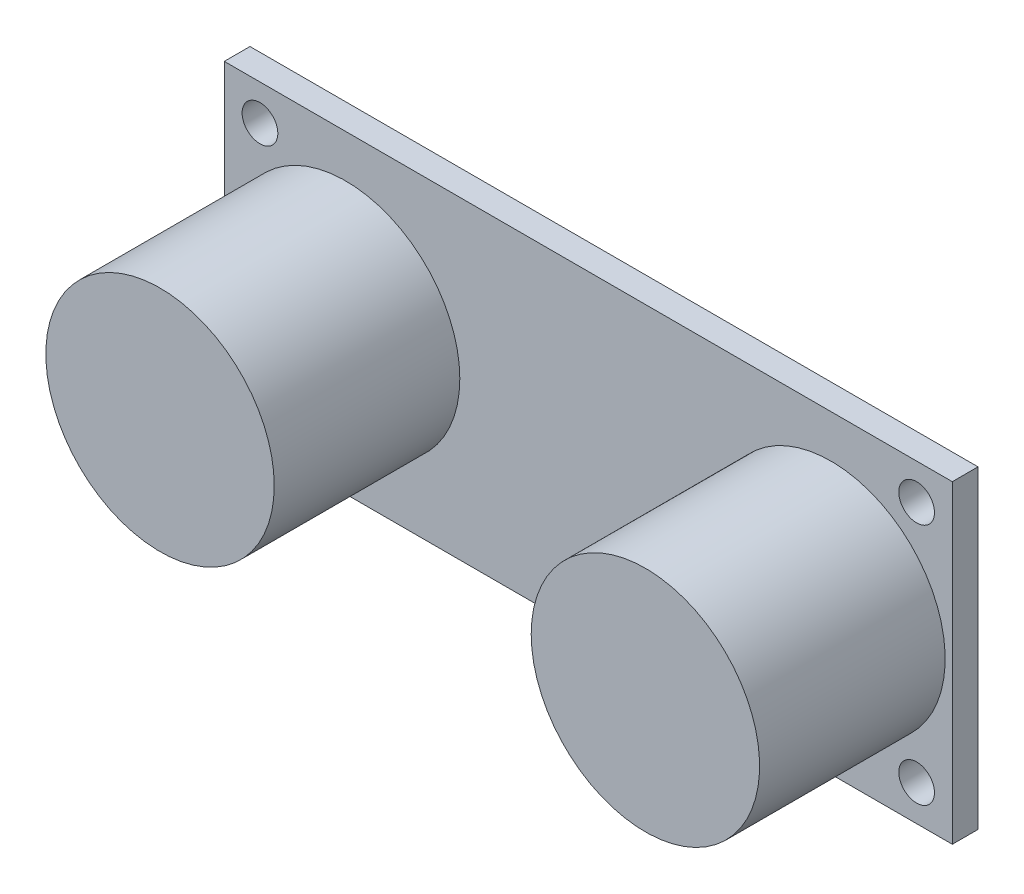
ISO-10303-21;
HEADER;
FILE_DESCRIPTION(('STEP AP214'),'2;1');
FILE_NAME('part.step','',(''),(''),'','','');
FILE_SCHEMA(('AUTOMOTIVE_DESIGN { 1 0 10303 214 1 1 1 1 }'));
ENDSEC;
DATA;
#1=APPLICATION_CONTEXT('core data for automotive mechanical design processes');
#2=APPLICATION_PROTOCOL_DEFINITION('international standard','automotive_design',2000,#1);
#3=PRODUCT_CONTEXT('',#1,'mechanical');
#4=PRODUCT('Part','Part','',(#3));
#5=PRODUCT_RELATED_PRODUCT_CATEGORY('part','',(#4));
#6=PRODUCT_DEFINITION_FORMATION('','',#4);
#7=PRODUCT_DEFINITION_CONTEXT('part definition',#1,'design');
#8=PRODUCT_DEFINITION('design','',#6,#7);
#9=PRODUCT_DEFINITION_SHAPE('','',#8);
#10=(LENGTH_UNIT() NAMED_UNIT(*) SI_UNIT(.MILLI.,.METRE.));
#11=(NAMED_UNIT(*) PLANE_ANGLE_UNIT() SI_UNIT($,.RADIAN.));
#12=(NAMED_UNIT(*) SI_UNIT($,.STERADIAN.) SOLID_ANGLE_UNIT());
#13=UNCERTAINTY_MEASURE_WITH_UNIT(LENGTH_MEASURE(1.E-05),#10,'distance_accuracy_value','');
#14=(GEOMETRIC_REPRESENTATION_CONTEXT(3) GLOBAL_UNCERTAINTY_ASSIGNED_CONTEXT((#13)) GLOBAL_UNIT_ASSIGNED_CONTEXT((#10,
#11,#12)) REPRESENTATION_CONTEXT('',''));
#15=CARTESIAN_POINT('',(0.,0.,0.));
#16=DIRECTION('',(0.,0.,1.));
#17=DIRECTION('',(1.,0.,0.));
#18=AXIS2_PLACEMENT_3D('',#15,#16,#17);
#19=CARTESIAN_POINT('',(0.,0.,1.8));
#20=DIRECTION('',(0.,0.,1.));
#21=DIRECTION('',(1.,0.,0.));
#22=AXIS2_PLACEMENT_3D('',#19,#20,#21);
#23=PLANE('',#22);
#24=CARTESIAN_POINT('',(17.,0.,1.8));
#25=DIRECTION('',(0.,0.,1.));
#26=DIRECTION('',(-1.,0.,0.));
#27=AXIS2_PLACEMENT_3D('',#24,#25,#26);
#28=CIRCLE('',#27,8.);
#29=CARTESIAN_POINT('',(9.,0.,1.8));
#30=VERTEX_POINT('',#29);
#31=EDGE_CURVE('E170',#30,#30,#28,.T.);
#32=ORIENTED_EDGE('',*,*,#31,.F.);
#33=EDGE_LOOP('',(#32));
#34=FACE_BOUND('',#33,.T.);
#35=CARTESIAN_POINT('',(-17.,0.,1.8));
#36=DIRECTION('',(0.,0.,1.));
#37=DIRECTION('',(1.,0.,0.));
#38=AXIS2_PLACEMENT_3D('',#35,#36,#37);
#39=CIRCLE('',#38,8.);
#40=CARTESIAN_POINT('',(-9.,0.,1.8));
#41=VERTEX_POINT('',#40);
#42=EDGE_CURVE('E162',#41,#41,#39,.T.);
#43=ORIENTED_EDGE('',*,*,#42,.F.);
#44=EDGE_LOOP('',(#43));
#45=FACE_BOUND('',#44,.T.);
#46=CARTESIAN_POINT('',(23.,8.49999999999999,1.8));
#47=DIRECTION('',(0.,0.,1.));
#48=DIRECTION('',(1.,0.,0.));
#49=AXIS2_PLACEMENT_3D('',#46,#47,#48);
#50=CIRCLE('',#49,1.25);
#51=CARTESIAN_POINT('',(24.25,8.49999999999999,1.8));
#52=VERTEX_POINT('',#51);
#53=EDGE_CURVE('E142',#52,#52,#50,.T.);
#54=ORIENTED_EDGE('',*,*,#53,.F.);
#55=EDGE_LOOP('',(#54));
#56=FACE_BOUND('',#55,.T.);
#57=CARTESIAN_POINT('',(-23.,-8.5,1.8));
#58=DIRECTION('',(0.,0.,1.));
#59=DIRECTION('',(1.,0.,0.));
#60=AXIS2_PLACEMENT_3D('',#57,#58,#59);
#61=CIRCLE('',#60,1.25);
#62=CARTESIAN_POINT('',(-21.75,-8.5,1.8));
#63=VERTEX_POINT('',#62);
#64=EDGE_CURVE('E112',#63,#63,#61,.T.);
#65=ORIENTED_EDGE('',*,*,#64,.F.);
#66=EDGE_LOOP('',(#65));
#67=FACE_BOUND('',#66,.T.);
#68=DIRECTION('',(0.,1.,0.));
#69=VECTOR('',#68,1.);
#70=CARTESIAN_POINT('',(25.5,11.,1.8));
#71=LINE('',#70,#69);
#72=CARTESIAN_POINT('',(25.5,-11.,1.8));
#73=VERTEX_POINT('',#72);
#74=CARTESIAN_POINT('',(25.5,11.,1.8));
#75=VERTEX_POINT('',#74);
#76=EDGE_CURVE('E92',#73,#75,#71,.T.);
#77=ORIENTED_EDGE('',*,*,#76,.T.);
#78=DIRECTION('',(-1.,0.,0.));
#79=VECTOR('',#78,1.);
#80=CARTESIAN_POINT('',(-25.5,11.,1.8));
#81=LINE('',#80,#79);
#82=CARTESIAN_POINT('',(-25.5,11.,1.8));
#83=VERTEX_POINT('',#82);
#84=EDGE_CURVE('E87',#75,#83,#81,.T.);
#85=ORIENTED_EDGE('',*,*,#84,.T.);
#86=DIRECTION('',(0.,-1.,0.));
#87=VECTOR('',#86,1.);
#88=CARTESIAN_POINT('',(-25.5,11.,1.8));
#89=LINE('',#88,#87);
#90=CARTESIAN_POINT('',(-25.5,-11.,1.8));
#91=VERTEX_POINT('',#90);
#92=EDGE_CURVE('E90',#83,#91,#89,.T.);
#93=ORIENTED_EDGE('',*,*,#92,.T.);
#94=DIRECTION('',(1.,0.,0.));
#95=VECTOR('',#94,1.);
#96=CARTESIAN_POINT('',(-25.5,-11.,1.8));
#97=LINE('',#96,#95);
#98=EDGE_CURVE('E57',#91,#73,#97,.T.);
#99=ORIENTED_EDGE('',*,*,#98,.T.);
#100=EDGE_LOOP('',(#77,#85,#93,#99));
#101=FACE_BOUND('',#100,.T.);
#102=CARTESIAN_POINT('',(-23.,8.5,1.8));
#103=DIRECTION('',(0.,0.,1.));
#104=DIRECTION('',(-1.,0.,0.));
#105=AXIS2_PLACEMENT_3D('',#102,#103,#104);
#106=CIRCLE('',#105,1.25);
#107=CARTESIAN_POINT('',(-24.25,8.5,1.8));
#108=VERTEX_POINT('',#107);
#109=EDGE_CURVE('E134',#108,#108,#106,.T.);
#110=ORIENTED_EDGE('',*,*,#109,.F.);
#111=EDGE_LOOP('',(#110));
#112=FACE_BOUND('',#111,.T.);
#113=CARTESIAN_POINT('',(23.,-8.49999999999999,1.8));
#114=DIRECTION('',(0.,0.,1.));
#115=DIRECTION('',(-1.,0.,0.));
#116=AXIS2_PLACEMENT_3D('',#113,#114,#115);
#117=CIRCLE('',#116,1.25);
#118=CARTESIAN_POINT('',(21.75,-8.49999999999999,1.8));
#119=VERTEX_POINT('',#118);
#120=EDGE_CURVE('E150',#119,#119,#117,.T.);
#121=ORIENTED_EDGE('',*,*,#120,.F.);
#122=EDGE_LOOP('',(#121));
#123=FACE_BOUND('',#122,.T.);
#124=ADVANCED_FACE('F39',(#34,#45,#56,#67,#101,#112,#123),#23,.T.);
#125=CARTESIAN_POINT('',(0.,0.,0.));
#126=DIRECTION('',(0.,0.,1.));
#127=DIRECTION('',(1.,0.,0.));
#128=AXIS2_PLACEMENT_3D('',#125,#126,#127);
#129=PLANE('',#128);
#130=DIRECTION('',(0.,1.,0.));
#131=VECTOR('',#130,1.);
#132=CARTESIAN_POINT('',(25.5,11.,0.));
#133=LINE('',#132,#131);
#134=CARTESIAN_POINT('',(25.5,-11.,0.));
#135=VERTEX_POINT('',#134);
#136=CARTESIAN_POINT('',(25.5,11.,0.));
#137=VERTEX_POINT('',#136);
#138=EDGE_CURVE('E108',#135,#137,#133,.T.);
#139=ORIENTED_EDGE('',*,*,#138,.F.);
#140=DIRECTION('',(1.,0.,0.));
#141=VECTOR('',#140,1.);
#142=CARTESIAN_POINT('',(-25.5,-11.,0.));
#143=LINE('',#142,#141);
#144=CARTESIAN_POINT('',(-25.5,-11.,0.));
#145=VERTEX_POINT('',#144);
#146=EDGE_CURVE('E80',#145,#135,#143,.T.);
#147=ORIENTED_EDGE('',*,*,#146,.F.);
#148=DIRECTION('',(0.,-1.,0.));
#149=VECTOR('',#148,1.);
#150=CARTESIAN_POINT('',(-25.5,11.,0.));
#151=LINE('',#150,#149);
#152=CARTESIAN_POINT('',(-25.5,11.,0.));
#153=VERTEX_POINT('',#152);
#154=EDGE_CURVE('E74',#153,#145,#151,.T.);
#155=ORIENTED_EDGE('',*,*,#154,.F.);
#156=DIRECTION('',(-1.,0.,0.));
#157=VECTOR('',#156,1.);
#158=CARTESIAN_POINT('',(-25.5,11.,0.));
#159=LINE('',#158,#157);
#160=EDGE_CURVE('E97',#137,#153,#159,.T.);
#161=ORIENTED_EDGE('',*,*,#160,.F.);
#162=EDGE_LOOP('',(#139,#147,#155,#161));
#163=FACE_BOUND('',#162,.T.);
#164=CARTESIAN_POINT('',(-23.,-8.5,0.));
#165=DIRECTION('',(0.,0.,1.));
#166=DIRECTION('',(1.,0.,0.));
#167=AXIS2_PLACEMENT_3D('',#164,#165,#166);
#168=CIRCLE('',#167,1.25);
#169=CARTESIAN_POINT('',(-21.75,-8.5,0.));
#170=VERTEX_POINT('',#169);
#171=EDGE_CURVE('E130',#170,#170,#168,.T.);
#172=ORIENTED_EDGE('',*,*,#171,.T.);
#173=EDGE_LOOP('',(#172));
#174=FACE_BOUND('',#173,.T.);
#175=CARTESIAN_POINT('',(-23.,8.5,0.));
#176=DIRECTION('',(0.,0.,1.));
#177=DIRECTION('',(-1.,0.,0.));
#178=AXIS2_PLACEMENT_3D('',#175,#176,#177);
#179=CIRCLE('',#178,1.25);
#180=CARTESIAN_POINT('',(-24.25,8.5,0.));
#181=VERTEX_POINT('',#180);
#182=EDGE_CURVE('E138',#181,#181,#179,.T.);
#183=ORIENTED_EDGE('',*,*,#182,.T.);
#184=EDGE_LOOP('',(#183));
#185=FACE_BOUND('',#184,.T.);
#186=CARTESIAN_POINT('',(23.,8.49999999999999,0.));
#187=DIRECTION('',(0.,0.,1.));
#188=DIRECTION('',(1.,0.,0.));
#189=AXIS2_PLACEMENT_3D('',#186,#187,#188);
#190=CIRCLE('',#189,1.25);
#191=CARTESIAN_POINT('',(24.25,8.49999999999999,0.));
#192=VERTEX_POINT('',#191);
#193=EDGE_CURVE('E146',#192,#192,#190,.T.);
#194=ORIENTED_EDGE('',*,*,#193,.T.);
#195=EDGE_LOOP('',(#194));
#196=FACE_BOUND('',#195,.T.);
#197=CARTESIAN_POINT('',(23.,-8.49999999999999,0.));
#198=DIRECTION('',(0.,0.,1.));
#199=DIRECTION('',(-1.,0.,0.));
#200=AXIS2_PLACEMENT_3D('',#197,#198,#199);
#201=CIRCLE('',#200,1.25);
#202=CARTESIAN_POINT('',(21.75,-8.49999999999999,0.));
#203=VERTEX_POINT('',#202);
#204=EDGE_CURVE('E154',#203,#203,#201,.T.);
#205=ORIENTED_EDGE('',*,*,#204,.T.);
#206=EDGE_LOOP('',(#205));
#207=FACE_BOUND('',#206,.T.);
#208=ADVANCED_FACE('F125',(#163,#174,#185,#196,#207),#129,.F.);
#209=CARTESIAN_POINT('',(25.5,11.,1.8));
#210=DIRECTION('',(-1.,0.,0.));
#211=DIRECTION('',(0.,0.,1.));
#212=AXIS2_PLACEMENT_3D('',#209,#210,#211);
#213=PLANE('',#212);
#214=ORIENTED_EDGE('',*,*,#138,.T.);
#215=DIRECTION('',(0.,0.,-1.));
#216=VECTOR('',#215,1.);
#217=CARTESIAN_POINT('',(25.5,11.,1.8));
#218=LINE('',#217,#216);
#219=EDGE_CURVE('E11',#75,#137,#218,.T.);
#220=ORIENTED_EDGE('',*,*,#219,.F.);
#221=ORIENTED_EDGE('',*,*,#76,.F.);
#222=DIRECTION('',(0.,0.,-1.));
#223=VECTOR('',#222,1.);
#224=CARTESIAN_POINT('',(25.5,-11.,1.8));
#225=LINE('',#224,#223);
#226=EDGE_CURVE('E104',#73,#135,#225,.T.);
#227=ORIENTED_EDGE('',*,*,#226,.T.);
#228=EDGE_LOOP('',(#214,#220,#221,#227));
#229=FACE_BOUND('',#228,.T.);
#230=ADVANCED_FACE('F41',(#229),#213,.F.);
#231=CARTESIAN_POINT('',(-25.5,11.,1.8));
#232=DIRECTION('',(0.,-1.,0.));
#233=DIRECTION('',(0.,0.,-1.));
#234=AXIS2_PLACEMENT_3D('',#231,#232,#233);
#235=PLANE('',#234);
#236=ORIENTED_EDGE('',*,*,#160,.T.);
#237=DIRECTION('',(0.,0.,-1.));
#238=VECTOR('',#237,1.);
#239=CARTESIAN_POINT('',(-25.5,11.,1.8));
#240=LINE('',#239,#238);
#241=EDGE_CURVE('E49',#83,#153,#240,.T.);
#242=ORIENTED_EDGE('',*,*,#241,.F.);
#243=ORIENTED_EDGE('',*,*,#84,.F.);
#244=ORIENTED_EDGE('',*,*,#219,.T.);
#245=EDGE_LOOP('',(#236,#242,#243,#244));
#246=FACE_BOUND('',#245,.T.);
#247=ADVANCED_FACE('F96',(#246),#235,.F.);
#248=CARTESIAN_POINT('',(-25.5,11.,1.8));
#249=DIRECTION('',(1.,0.,0.));
#250=DIRECTION('',(0.,1.,0.));
#251=AXIS2_PLACEMENT_3D('',#248,#249,#250);
#252=PLANE('',#251);
#253=ORIENTED_EDGE('',*,*,#154,.T.);
#254=DIRECTION('',(0.,0.,-1.));
#255=VECTOR('',#254,1.);
#256=CARTESIAN_POINT('',(-25.5,-11.,1.8));
#257=LINE('',#256,#255);
#258=EDGE_CURVE('E99',#91,#145,#257,.T.);
#259=ORIENTED_EDGE('',*,*,#258,.F.);
#260=ORIENTED_EDGE('',*,*,#92,.F.);
#261=ORIENTED_EDGE('',*,*,#241,.T.);
#262=EDGE_LOOP('',(#253,#259,#260,#261));
#263=FACE_BOUND('',#262,.T.);
#264=ADVANCED_FACE('F100',(#263),#252,.F.);
#265=CARTESIAN_POINT('',(-25.5,-11.,1.8));
#266=DIRECTION('',(0.,1.,0.));
#267=DIRECTION('',(0.,0.,1.));
#268=AXIS2_PLACEMENT_3D('',#265,#266,#267);
#269=PLANE('',#268);
#270=ORIENTED_EDGE('',*,*,#146,.T.);
#271=ORIENTED_EDGE('',*,*,#226,.F.);
#272=ORIENTED_EDGE('',*,*,#98,.F.);
#273=ORIENTED_EDGE('',*,*,#258,.T.);
#274=EDGE_LOOP('',(#270,#271,#272,#273));
#275=FACE_BOUND('',#274,.T.);
#276=ADVANCED_FACE('F122',(#275),#269,.F.);
#277=CARTESIAN_POINT('',(-23.,-8.5,1.8));
#278=DIRECTION('',(0.,0.,-1.));
#279=DIRECTION('',(-1.,0.,0.));
#280=AXIS2_PLACEMENT_3D('',#277,#278,#279);
#281=CYLINDRICAL_SURFACE('',#280,1.25);
#282=ORIENTED_EDGE('',*,*,#64,.T.);
#283=EDGE_LOOP('',(#282));
#284=FACE_BOUND('',#283,.T.);
#285=ORIENTED_EDGE('',*,*,#171,.F.);
#286=EDGE_LOOP('',(#285));
#287=FACE_BOUND('',#286,.T.);
#288=ADVANCED_FACE('F196',(#284,#287),#281,.F.);
#289=CARTESIAN_POINT('',(-23.,8.5,1.8));
#290=DIRECTION('',(0.,0.,-1.));
#291=DIRECTION('',(-1.,0.,0.));
#292=AXIS2_PLACEMENT_3D('',#289,#290,#291);
#293=CYLINDRICAL_SURFACE('',#292,1.25);
#294=ORIENTED_EDGE('',*,*,#109,.T.);
#295=EDGE_LOOP('',(#294));
#296=FACE_BOUND('',#295,.T.);
#297=ORIENTED_EDGE('',*,*,#182,.F.);
#298=EDGE_LOOP('',(#297));
#299=FACE_BOUND('',#298,.T.);
#300=ADVANCED_FACE('F199',(#296,#299),#293,.F.);
#301=CARTESIAN_POINT('',(23.,8.49999999999999,1.8));
#302=DIRECTION('',(0.,0.,-1.));
#303=DIRECTION('',(-1.,0.,0.));
#304=AXIS2_PLACEMENT_3D('',#301,#302,#303);
#305=CYLINDRICAL_SURFACE('',#304,1.25);
#306=ORIENTED_EDGE('',*,*,#53,.T.);
#307=EDGE_LOOP('',(#306));
#308=FACE_BOUND('',#307,.T.);
#309=ORIENTED_EDGE('',*,*,#193,.F.);
#310=EDGE_LOOP('',(#309));
#311=FACE_BOUND('',#310,.T.);
#312=ADVANCED_FACE('F214',(#308,#311),#305,.F.);
#313=CARTESIAN_POINT('',(23.,-8.49999999999999,1.8));
#314=DIRECTION('',(0.,0.,-1.));
#315=DIRECTION('',(-1.,0.,0.));
#316=AXIS2_PLACEMENT_3D('',#313,#314,#315);
#317=CYLINDRICAL_SURFACE('',#316,1.25);
#318=ORIENTED_EDGE('',*,*,#120,.T.);
#319=EDGE_LOOP('',(#318));
#320=FACE_BOUND('',#319,.T.);
#321=ORIENTED_EDGE('',*,*,#204,.F.);
#322=EDGE_LOOP('',(#321));
#323=FACE_BOUND('',#322,.T.);
#324=ADVANCED_FACE('F211',(#320,#323),#317,.F.);
#325=CARTESIAN_POINT('',(-17.,0.,14.8));
#326=DIRECTION('',(0.,0.,-1.));
#327=DIRECTION('',(-1.,0.,0.));
#328=AXIS2_PLACEMENT_3D('',#325,#326,#327);
#329=CYLINDRICAL_SURFACE('',#328,8.);
#330=CARTESIAN_POINT('',(-17.,0.,14.8));
#331=DIRECTION('',(0.,0.,1.));
#332=DIRECTION('',(1.,0.,0.));
#333=AXIS2_PLACEMENT_3D('',#330,#331,#332);
#334=CIRCLE('',#333,8.);
#335=CARTESIAN_POINT('',(-9.,0.,14.8));
#336=VERTEX_POINT('',#335);
#337=EDGE_CURVE('E158',#336,#336,#334,.T.);
#338=ORIENTED_EDGE('',*,*,#337,.F.);
#339=EDGE_LOOP('',(#338));
#340=FACE_BOUND('',#339,.T.);
#341=ORIENTED_EDGE('',*,*,#42,.T.);
#342=EDGE_LOOP('',(#341));
#343=FACE_BOUND('',#342,.T.);
#344=ADVANCED_FACE('F213',(#340,#343),#329,.T.);
#345=CARTESIAN_POINT('',(-17.,0.,14.8));
#346=DIRECTION('',(0.,0.,1.));
#347=DIRECTION('',(1.,0.,0.));
#348=AXIS2_PLACEMENT_3D('',#345,#346,#347);
#349=PLANE('',#348);
#350=ORIENTED_EDGE('',*,*,#337,.T.);
#351=EDGE_LOOP('',(#350));
#352=FACE_BOUND('',#351,.T.);
#353=ADVANCED_FACE('F183',(#352),#349,.T.);
#354=CARTESIAN_POINT('',(17.,0.,14.8));
#355=DIRECTION('',(0.,0.,-1.));
#356=DIRECTION('',(-1.,0.,0.));
#357=AXIS2_PLACEMENT_3D('',#354,#355,#356);
#358=CYLINDRICAL_SURFACE('',#357,8.);
#359=CARTESIAN_POINT('',(17.,0.,14.8));
#360=DIRECTION('',(0.,0.,1.));
#361=DIRECTION('',(-1.,0.,0.));
#362=AXIS2_PLACEMENT_3D('',#359,#360,#361);
#363=CIRCLE('',#362,8.);
#364=CARTESIAN_POINT('',(9.,0.,14.8));
#365=VERTEX_POINT('',#364);
#366=EDGE_CURVE('E166',#365,#365,#363,.T.);
#367=ORIENTED_EDGE('',*,*,#366,.F.);
#368=EDGE_LOOP('',(#367));
#369=FACE_BOUND('',#368,.T.);
#370=ORIENTED_EDGE('',*,*,#31,.T.);
#371=EDGE_LOOP('',(#370));
#372=FACE_BOUND('',#371,.T.);
#373=ADVANCED_FACE('F180',(#369,#372),#358,.T.);
#374=CARTESIAN_POINT('',(17.,0.,14.8));
#375=DIRECTION('',(0.,0.,-1.));
#376=DIRECTION('',(-1.,0.,0.));
#377=AXIS2_PLACEMENT_3D('',#374,#375,#376);
#378=PLANE('',#377);
#379=ORIENTED_EDGE('',*,*,#366,.T.);
#380=EDGE_LOOP('',(#379));
#381=FACE_BOUND('',#380,.T.);
#382=ADVANCED_FACE('F178',(#381),#378,.F.);
#383=CLOSED_SHELL('',(#124,#208,#230,#247,#264,#276,#288,#300,#312,#324,#344,#353,#373,#382));
#384=MANIFOLD_SOLID_BREP('B2',#383);
#385=ADVANCED_BREP_SHAPE_REPRESENTATION('',(#18,#384),#14);
#386=SHAPE_DEFINITION_REPRESENTATION(#9,#385);
ENDSEC;
END-ISO-10303-21;
